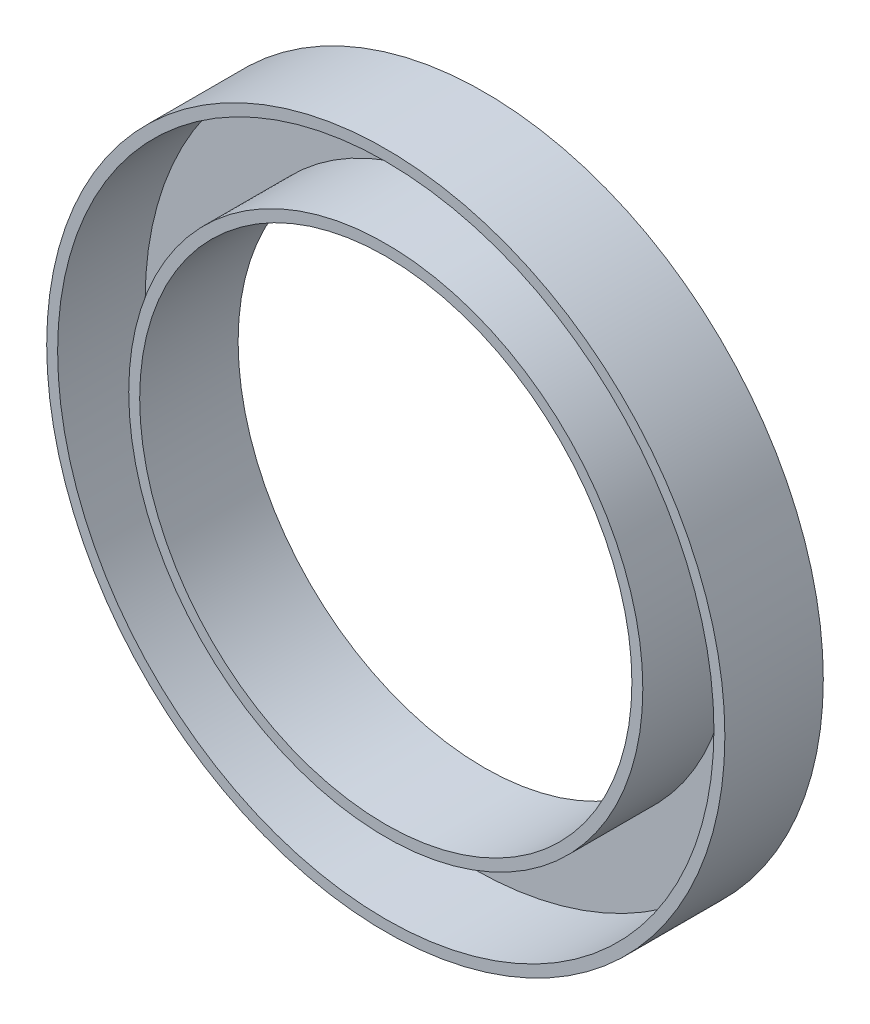
ISO-10303-21;
HEADER;
FILE_DESCRIPTION(('STEP AP214'),'2;1');
FILE_NAME('part.step','',(''),(''),'','','');
FILE_SCHEMA(('AUTOMOTIVE_DESIGN { 1 0 10303 214 1 1 1 1 }'));
ENDSEC;
DATA;
#1=APPLICATION_CONTEXT('core data for automotive mechanical design processes');
#2=APPLICATION_PROTOCOL_DEFINITION('international standard','automotive_design',2000,#1);
#3=PRODUCT_CONTEXT('',#1,'mechanical');
#4=PRODUCT('Part','Part','',(#3));
#5=PRODUCT_RELATED_PRODUCT_CATEGORY('part','',(#4));
#6=PRODUCT_DEFINITION_FORMATION('','',#4);
#7=PRODUCT_DEFINITION_CONTEXT('part definition',#1,'design');
#8=PRODUCT_DEFINITION('design','',#6,#7);
#9=PRODUCT_DEFINITION_SHAPE('','',#8);
#10=(LENGTH_UNIT() NAMED_UNIT(*) SI_UNIT(.MILLI.,.METRE.));
#11=(NAMED_UNIT(*) PLANE_ANGLE_UNIT() SI_UNIT($,.RADIAN.));
#12=(NAMED_UNIT(*) SI_UNIT($,.STERADIAN.) SOLID_ANGLE_UNIT());
#13=UNCERTAINTY_MEASURE_WITH_UNIT(LENGTH_MEASURE(1.E-05),#10,'distance_accuracy_value','');
#14=(GEOMETRIC_REPRESENTATION_CONTEXT(3) GLOBAL_UNCERTAINTY_ASSIGNED_CONTEXT((#13)) GLOBAL_UNIT_ASSIGNED_CONTEXT((#10,
#11,#12)) REPRESENTATION_CONTEXT('',''));
#15=CARTESIAN_POINT('',(0.,0.,0.));
#16=DIRECTION('',(0.,0.,1.));
#17=DIRECTION('',(1.,0.,0.));
#18=AXIS2_PLACEMENT_3D('',#15,#16,#17);
#19=CARTESIAN_POINT('',(0.,0.,9.));
#20=DIRECTION('',(0.,0.,1.));
#21=DIRECTION('',(1.,0.,0.));
#22=AXIS2_PLACEMENT_3D('',#19,#20,#21);
#23=PLANE('',#22);
#24=CARTESIAN_POINT('',(0.,0.,9.));
#25=DIRECTION('',(0.,0.,1.));
#26=DIRECTION('',(1.,0.,0.));
#27=AXIS2_PLACEMENT_3D('',#24,#25,#26);
#28=CIRCLE('',#27,22.5);
#29=CARTESIAN_POINT('',(22.5,0.,9.));
#30=VERTEX_POINT('',#29);
#31=EDGE_CURVE('E41',#30,#30,#28,.T.);
#32=ORIENTED_EDGE('',*,*,#31,.F.);
#33=EDGE_LOOP('',(#32));
#34=FACE_BOUND('',#33,.T.);
#35=CARTESIAN_POINT('',(0.,0.,9.));
#36=DIRECTION('',(0.,0.,1.));
#37=DIRECTION('',(1.,0.,0.));
#38=AXIS2_PLACEMENT_3D('',#35,#36,#37);
#39=CIRCLE('',#38,23.5);
#40=CARTESIAN_POINT('',(23.5,0.,9.));
#41=VERTEX_POINT('',#40);
#42=EDGE_CURVE('E49',#41,#41,#39,.T.);
#43=ORIENTED_EDGE('',*,*,#42,.T.);
#44=EDGE_LOOP('',(#43));
#45=FACE_BOUND('',#44,.T.);
#46=ADVANCED_FACE('F30',(#34,#45),#23,.T.);
#47=CARTESIAN_POINT('',(0.,0.,9.));
#48=DIRECTION('',(0.,0.,1.));
#49=DIRECTION('',(1.,0.,0.));
#50=AXIS2_PLACEMENT_3D('',#47,#48,#49);
#51=CIRCLE('',#50,30.);
#52=CARTESIAN_POINT('',(30.,0.,9.));
#53=VERTEX_POINT('',#52);
#54=EDGE_CURVE('E46',#53,#53,#51,.T.);
#55=ORIENTED_EDGE('',*,*,#54,.F.);
#56=EDGE_LOOP('',(#55));
#57=FACE_BOUND('',#56,.T.);
#58=CARTESIAN_POINT('',(0.,0.,9.));
#59=DIRECTION('',(0.,0.,1.));
#60=DIRECTION('',(1.,0.,0.));
#61=AXIS2_PLACEMENT_3D('',#58,#59,#60);
#62=CIRCLE('',#61,31.);
#63=CARTESIAN_POINT('',(31.,0.,9.));
#64=VERTEX_POINT('',#63);
#65=EDGE_CURVE('E10',#64,#64,#62,.T.);
#66=ORIENTED_EDGE('',*,*,#65,.T.);
#67=EDGE_LOOP('',(#66));
#68=FACE_BOUND('',#67,.T.);
#69=ADVANCED_FACE('F78',(#57,#68),#23,.T.);
#70=CARTESIAN_POINT('',(0.,0.,0.));
#71=DIRECTION('',(0.,0.,1.));
#72=DIRECTION('',(1.,0.,0.));
#73=AXIS2_PLACEMENT_3D('',#70,#71,#72);
#74=PLANE('',#73);
#75=CARTESIAN_POINT('',(0.,0.,0.));
#76=DIRECTION('',(0.,0.,1.));
#77=DIRECTION('',(1.,0.,0.));
#78=AXIS2_PLACEMENT_3D('',#75,#76,#77);
#79=CIRCLE('',#78,31.);
#80=CARTESIAN_POINT('',(31.,0.,0.));
#81=VERTEX_POINT('',#80);
#82=EDGE_CURVE('E34',#81,#81,#79,.T.);
#83=ORIENTED_EDGE('',*,*,#82,.F.);
#84=EDGE_LOOP('',(#83));
#85=FACE_BOUND('',#84,.T.);
#86=CARTESIAN_POINT('',(0.,0.,0.));
#87=DIRECTION('',(0.,0.,1.));
#88=DIRECTION('',(1.,0.,0.));
#89=AXIS2_PLACEMENT_3D('',#86,#87,#88);
#90=CIRCLE('',#89,22.5);
#91=CARTESIAN_POINT('',(22.5,0.,0.));
#92=VERTEX_POINT('',#91);
#93=EDGE_CURVE('E43',#92,#92,#90,.T.);
#94=ORIENTED_EDGE('',*,*,#93,.T.);
#95=EDGE_LOOP('',(#94));
#96=FACE_BOUND('',#95,.T.);
#97=ADVANCED_FACE('F84',(#85,#96),#74,.F.);
#98=CARTESIAN_POINT('',(0.,0.,9.));
#99=DIRECTION('',(0.,0.,-1.));
#100=DIRECTION('',(-1.,0.,0.));
#101=AXIS2_PLACEMENT_3D('',#98,#99,#100);
#102=CYLINDRICAL_SURFACE('',#101,31.);
#103=ORIENTED_EDGE('',*,*,#65,.F.);
#104=EDGE_LOOP('',(#103));
#105=FACE_BOUND('',#104,.T.);
#106=ORIENTED_EDGE('',*,*,#82,.T.);
#107=EDGE_LOOP('',(#106));
#108=FACE_BOUND('',#107,.T.);
#109=ADVANCED_FACE('F32',(#105,#108),#102,.T.);
#110=CARTESIAN_POINT('',(0.,0.,9.));
#111=DIRECTION('',(0.,0.,-1.));
#112=DIRECTION('',(-1.,0.,0.));
#113=AXIS2_PLACEMENT_3D('',#110,#111,#112);
#114=CYLINDRICAL_SURFACE('',#113,22.5);
#115=ORIENTED_EDGE('',*,*,#31,.T.);
#116=EDGE_LOOP('',(#115));
#117=FACE_BOUND('',#116,.T.);
#118=ORIENTED_EDGE('',*,*,#93,.F.);
#119=EDGE_LOOP('',(#118));
#120=FACE_BOUND('',#119,.T.);
#121=ADVANCED_FACE('F75',(#117,#120),#114,.F.);
#122=CARTESIAN_POINT('',(0.,0.,1.));
#123=DIRECTION('',(0.,0.,1.));
#124=DIRECTION('',(1.,0.,0.));
#125=AXIS2_PLACEMENT_3D('',#122,#123,#124);
#126=PLANE('',#125);
#127=CARTESIAN_POINT('',(0.,0.,0.999999999999999));
#128=DIRECTION('',(0.,0.,1.));
#129=DIRECTION('',(1.,0.,0.));
#130=AXIS2_PLACEMENT_3D('',#127,#128,#129);
#131=CIRCLE('',#130,30.);
#132=CARTESIAN_POINT('',(30.,0.,0.999999999999999));
#133=VERTEX_POINT('',#132);
#134=EDGE_CURVE('E52',#133,#133,#131,.T.);
#135=ORIENTED_EDGE('',*,*,#134,.T.);
#136=EDGE_LOOP('',(#135));
#137=FACE_BOUND('',#136,.T.);
#138=CARTESIAN_POINT('',(0.,0.,0.999999999999999));
#139=DIRECTION('',(0.,0.,1.));
#140=DIRECTION('',(1.,0.,0.));
#141=AXIS2_PLACEMENT_3D('',#138,#139,#140);
#142=CIRCLE('',#141,23.5);
#143=CARTESIAN_POINT('',(23.5,0.,0.999999999999999));
#144=VERTEX_POINT('',#143);
#145=EDGE_CURVE('E53',#144,#144,#142,.T.);
#146=ORIENTED_EDGE('',*,*,#145,.F.);
#147=EDGE_LOOP('',(#146));
#148=FACE_BOUND('',#147,.T.);
#149=ADVANCED_FACE('F61',(#137,#148),#126,.T.);
#150=CARTESIAN_POINT('',(0.,0.,9.));
#151=DIRECTION('',(0.,0.,-1.));
#152=DIRECTION('',(-1.,0.,0.));
#153=AXIS2_PLACEMENT_3D('',#150,#151,#152);
#154=CYLINDRICAL_SURFACE('',#153,30.);
#155=ORIENTED_EDGE('',*,*,#54,.T.);
#156=EDGE_LOOP('',(#155));
#157=FACE_BOUND('',#156,.T.);
#158=ORIENTED_EDGE('',*,*,#134,.F.);
#159=EDGE_LOOP('',(#158));
#160=FACE_BOUND('',#159,.T.);
#161=ADVANCED_FACE('F64',(#157,#160),#154,.F.);
#162=CARTESIAN_POINT('',(0.,0.,9.));
#163=DIRECTION('',(0.,0.,-1.));
#164=DIRECTION('',(-1.,0.,0.));
#165=AXIS2_PLACEMENT_3D('',#162,#163,#164);
#166=CYLINDRICAL_SURFACE('',#165,23.5);
#167=ORIENTED_EDGE('',*,*,#42,.F.);
#168=EDGE_LOOP('',(#167));
#169=FACE_BOUND('',#168,.T.);
#170=ORIENTED_EDGE('',*,*,#145,.T.);
#171=EDGE_LOOP('',(#170));
#172=FACE_BOUND('',#171,.T.);
#173=ADVANCED_FACE('F66',(#169,#172),#166,.T.);
#174=CLOSED_SHELL('',(#46,#69,#97,#109,#121,#149,#161,#173));
#175=MANIFOLD_SOLID_BREP('B2',#174);
#176=ADVANCED_BREP_SHAPE_REPRESENTATION('',(#18,#175),#14);
#177=SHAPE_DEFINITION_REPRESENTATION(#9,#176);
ENDSEC;
END-ISO-10303-21;
